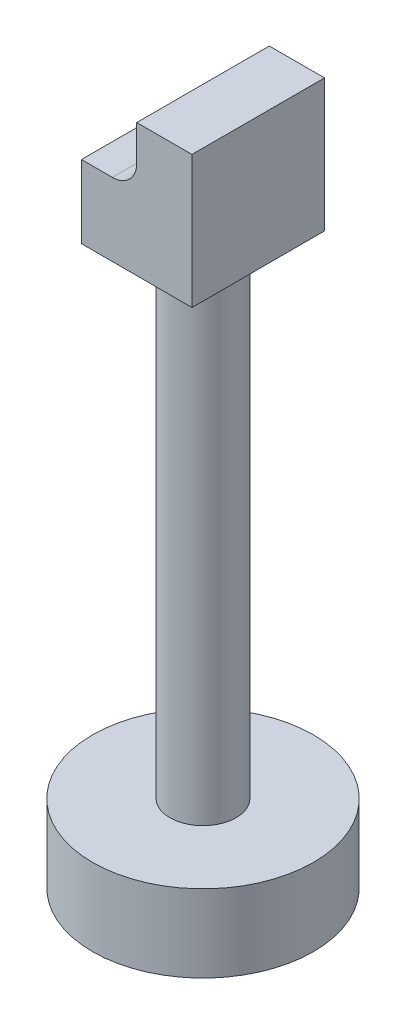
ISO-10303-21;
HEADER;
FILE_DESCRIPTION(('STEP AP214'),'2;1');
FILE_NAME('part.step','',(''),(''),'','','');
FILE_SCHEMA(('AUTOMOTIVE_DESIGN { 1 0 10303 214 1 1 1 1 }'));
ENDSEC;
DATA;
#1=APPLICATION_CONTEXT('core data for automotive mechanical design processes');
#2=APPLICATION_PROTOCOL_DEFINITION('international standard','automotive_design',2000,#1);
#3=PRODUCT_CONTEXT('',#1,'mechanical');
#4=PRODUCT('Part','Part','',(#3));
#5=PRODUCT_RELATED_PRODUCT_CATEGORY('part','',(#4));
#6=PRODUCT_DEFINITION_FORMATION('','',#4);
#7=PRODUCT_DEFINITION_CONTEXT('part definition',#1,'design');
#8=PRODUCT_DEFINITION('design','',#6,#7);
#9=PRODUCT_DEFINITION_SHAPE('','',#8);
#10=(LENGTH_UNIT() NAMED_UNIT(*) SI_UNIT(.MILLI.,.METRE.));
#11=(NAMED_UNIT(*) PLANE_ANGLE_UNIT() SI_UNIT($,.RADIAN.));
#12=(NAMED_UNIT(*) SI_UNIT($,.STERADIAN.) SOLID_ANGLE_UNIT());
#13=UNCERTAINTY_MEASURE_WITH_UNIT(LENGTH_MEASURE(1.E-05),#10,'distance_accuracy_value','');
#14=(GEOMETRIC_REPRESENTATION_CONTEXT(3) GLOBAL_UNCERTAINTY_ASSIGNED_CONTEXT((#13)) GLOBAL_UNIT_ASSIGNED_CONTEXT((#10,
#11,#12)) REPRESENTATION_CONTEXT('',''));
#15=CARTESIAN_POINT('',(0.,0.,0.));
#16=DIRECTION('',(0.,0.,1.));
#17=DIRECTION('',(1.,0.,0.));
#18=AXIS2_PLACEMENT_3D('',#15,#16,#17);
#19=CARTESIAN_POINT('',(0.,35.,0.));
#20=DIRECTION('',(0.,1.,0.));
#21=DIRECTION('',(0.,0.,1.));
#22=AXIS2_PLACEMENT_3D('',#19,#20,#21);
#23=PLANE('',#22);
#24=CARTESIAN_POINT('',(0.,35.,0.));
#25=DIRECTION('',(0.,1.,0.));
#26=DIRECTION('',(0.,0.,1.));
#27=AXIS2_PLACEMENT_3D('',#24,#25,#26);
#28=CIRCLE('',#27,50.);
#29=CARTESIAN_POINT('',(0.,35.,50.));
#30=VERTEX_POINT('',#29);
#31=EDGE_CURVE('E40',#30,#30,#28,.T.);
#32=ORIENTED_EDGE('',*,*,#31,.T.);
#33=EDGE_LOOP('',(#32));
#34=FACE_BOUND('',#33,.T.);
#35=CARTESIAN_POINT('',(0.,35.,0.));
#36=DIRECTION('',(0.,1.,0.));
#37=DIRECTION('',(0.,0.,1.));
#38=AXIS2_PLACEMENT_3D('',#35,#36,#37);
#39=CIRCLE('',#38,15.);
#40=CARTESIAN_POINT('',(0.,35.,15.));
#41=VERTEX_POINT('',#40);
#42=EDGE_CURVE('E114',#41,#41,#39,.T.);
#43=ORIENTED_EDGE('',*,*,#42,.F.);
#44=EDGE_LOOP('',(#43));
#45=FACE_BOUND('',#44,.T.);
#46=ADVANCED_FACE('F32',(#34,#45),#23,.T.);
#47=CARTESIAN_POINT('',(0.,35.,0.));
#48=DIRECTION('',(0.,-1.,0.));
#49=DIRECTION('',(0.,0.,-1.));
#50=AXIS2_PLACEMENT_3D('',#47,#48,#49);
#51=CYLINDRICAL_SURFACE('',#50,50.);
#52=ORIENTED_EDGE('',*,*,#31,.F.);
#53=EDGE_LOOP('',(#52));
#54=FACE_BOUND('',#53,.T.);
#55=CARTESIAN_POINT('',(0.,0.,0.));
#56=DIRECTION('',(0.,1.,0.));
#57=DIRECTION('',(0.,0.,1.));
#58=AXIS2_PLACEMENT_3D('',#55,#56,#57);
#59=CIRCLE('',#58,50.);
#60=CARTESIAN_POINT('',(0.,0.,50.));
#61=VERTEX_POINT('',#60);
#62=EDGE_CURVE('E118',#61,#61,#59,.T.);
#63=ORIENTED_EDGE('',*,*,#62,.T.);
#64=EDGE_LOOP('',(#63));
#65=FACE_BOUND('',#64,.T.);
#66=ADVANCED_FACE('F34',(#54,#65),#51,.T.);
#67=CARTESIAN_POINT('',(0.,0.,0.));
#68=DIRECTION('',(0.,1.,0.));
#69=DIRECTION('',(0.,0.,1.));
#70=AXIS2_PLACEMENT_3D('',#67,#68,#69);
#71=PLANE('',#70);
#72=ORIENTED_EDGE('',*,*,#62,.F.);
#73=EDGE_LOOP('',(#72));
#74=FACE_BOUND('',#73,.T.);
#75=ADVANCED_FACE('F126',(#74),#71,.F.);
#76=CARTESIAN_POINT('',(0.,255.,0.));
#77=DIRECTION('',(0.,-1.,0.));
#78=DIRECTION('',(0.,0.,-1.));
#79=AXIS2_PLACEMENT_3D('',#76,#77,#78);
#80=CYLINDRICAL_SURFACE('',#79,15.);
#81=CARTESIAN_POINT('',(0.,255.,0.));
#82=DIRECTION('',(0.,1.,0.));
#83=DIRECTION('',(0.,0.,1.));
#84=AXIS2_PLACEMENT_3D('',#81,#82,#83);
#85=CIRCLE('',#84,15.);
#86=CARTESIAN_POINT('',(0.,255.,15.));
#87=VERTEX_POINT('',#86);
#88=EDGE_CURVE('E115',#87,#87,#85,.T.);
#89=ORIENTED_EDGE('',*,*,#88,.F.);
#90=EDGE_LOOP('',(#89));
#91=FACE_BOUND('',#90,.T.);
#92=ORIENTED_EDGE('',*,*,#42,.T.);
#93=EDGE_LOOP('',(#92));
#94=FACE_BOUND('',#93,.T.);
#95=ADVANCED_FACE('F128',(#91,#94),#80,.T.);
#96=CARTESIAN_POINT('',(0.,255.,0.));
#97=DIRECTION('',(0.,-1.,0.));
#98=DIRECTION('',(0.,0.,-1.));
#99=AXIS2_PLACEMENT_3D('',#96,#97,#98);
#100=PLANE('',#99);
#101=DIRECTION('',(0.,0.,-1.));
#102=VECTOR('',#101,1.);
#103=CARTESIAN_POINT('',(25.,255.,30.));
#104=LINE('',#103,#102);
#105=CARTESIAN_POINT('',(25.,255.,30.));
#106=VERTEX_POINT('',#105);
#107=CARTESIAN_POINT('',(25.,255.,-30.));
#108=VERTEX_POINT('',#107);
#109=EDGE_CURVE('E92',#106,#108,#104,.T.);
#110=ORIENTED_EDGE('',*,*,#109,.F.);
#111=DIRECTION('',(1.,0.,0.));
#112=VECTOR('',#111,1.);
#113=CARTESIAN_POINT('',(-25.,255.,30.));
#114=LINE('',#113,#112);
#115=CARTESIAN_POINT('',(-25.,255.,30.));
#116=VERTEX_POINT('',#115);
#117=EDGE_CURVE('E73',#116,#106,#114,.T.);
#118=ORIENTED_EDGE('',*,*,#117,.F.);
#119=DIRECTION('',(0.,0.,1.));
#120=VECTOR('',#119,1.);
#121=CARTESIAN_POINT('',(-25.,255.,30.));
#122=LINE('',#121,#120);
#123=CARTESIAN_POINT('',(-25.,255.,-30.));
#124=VERTEX_POINT('',#123);
#125=EDGE_CURVE('E86',#124,#116,#122,.T.);
#126=ORIENTED_EDGE('',*,*,#125,.F.);
#127=DIRECTION('',(-1.,0.,0.));
#128=VECTOR('',#127,1.);
#129=CARTESIAN_POINT('',(-25.,255.,-30.));
#130=LINE('',#129,#128);
#131=EDGE_CURVE('E97',#108,#124,#130,.T.);
#132=ORIENTED_EDGE('',*,*,#131,.F.);
#133=EDGE_LOOP('',(#110,#118,#126,#132));
#134=FACE_BOUND('',#133,.T.);
#135=ORIENTED_EDGE('',*,*,#88,.T.);
#136=EDGE_LOOP('',(#135));
#137=FACE_BOUND('',#136,.T.);
#138=ADVANCED_FACE('F94',(#134,#137),#100,.T.);
#139=CARTESIAN_POINT('',(25.,315.,30.));
#140=DIRECTION('',(-1.,0.,0.));
#141=DIRECTION('',(0.,0.,1.));
#142=AXIS2_PLACEMENT_3D('',#139,#140,#141);
#143=PLANE('',#142);
#144=ORIENTED_EDGE('',*,*,#109,.T.);
#145=DIRECTION('',(0.,-1.,0.));
#146=VECTOR('',#145,1.);
#147=CARTESIAN_POINT('',(25.,315.,-30.));
#148=LINE('',#147,#146);
#149=CARTESIAN_POINT('',(25.,315.,-30.));
#150=VERTEX_POINT('',#149);
#151=EDGE_CURVE('E112',#150,#108,#148,.T.);
#152=ORIENTED_EDGE('',*,*,#151,.F.);
#153=DIRECTION('',(0.,0.,-1.));
#154=VECTOR('',#153,1.);
#155=CARTESIAN_POINT('',(25.,315.,30.));
#156=LINE('',#155,#154);
#157=CARTESIAN_POINT('',(25.,315.,30.));
#158=VERTEX_POINT('',#157);
#159=EDGE_CURVE('E85',#158,#150,#156,.T.);
#160=ORIENTED_EDGE('',*,*,#159,.F.);
#161=DIRECTION('',(0.,-1.,0.));
#162=VECTOR('',#161,1.);
#163=CARTESIAN_POINT('',(25.,315.,30.));
#164=LINE('',#163,#162);
#165=EDGE_CURVE('E76',#158,#106,#164,.T.);
#166=ORIENTED_EDGE('',*,*,#165,.T.);
#167=EDGE_LOOP('',(#144,#152,#160,#166));
#168=FACE_BOUND('',#167,.T.);
#169=ADVANCED_FACE('F90',(#168),#143,.F.);
#170=CARTESIAN_POINT('',(-25.,315.,-30.));
#171=DIRECTION('',(0.,0.,1.));
#172=DIRECTION('',(1.,0.,0.));
#173=AXIS2_PLACEMENT_3D('',#170,#171,#172);
#174=PLANE('',#173);
#175=CARTESIAN_POINT('',(-11.,299.,-30.));
#176=DIRECTION('',(0.,0.,1.));
#177=DIRECTION('',(1.,0.,0.));
#178=AXIS2_PLACEMENT_3D('',#175,#176,#177);
#179=CIRCLE('',#178,11.);
#180=CARTESIAN_POINT('',(-11.,288.,-30.));
#181=VERTEX_POINT('',#180);
#182=CARTESIAN_POINT('',(0.,299.,-30.));
#183=VERTEX_POINT('',#182);
#184=EDGE_CURVE('E99',#181,#183,#179,.T.);
#185=ORIENTED_EDGE('',*,*,#184,.T.);
#186=DIRECTION('',(0.,1.,0.));
#187=VECTOR('',#186,1.);
#188=CARTESIAN_POINT('',(0.,315.,-30.));
#189=LINE('',#188,#187);
#190=CARTESIAN_POINT('',(0.,315.,-30.));
#191=VERTEX_POINT('',#190);
#192=EDGE_CURVE('E179',#183,#191,#189,.T.);
#193=ORIENTED_EDGE('',*,*,#192,.T.);
#194=DIRECTION('',(-1.,0.,0.));
#195=VECTOR('',#194,1.);
#196=CARTESIAN_POINT('',(-25.,315.,-30.));
#197=LINE('',#196,#195);
#198=EDGE_CURVE('E203',#150,#191,#197,.T.);
#199=ORIENTED_EDGE('',*,*,#198,.F.);
#200=ORIENTED_EDGE('',*,*,#151,.T.);
#201=ORIENTED_EDGE('',*,*,#131,.T.);
#202=DIRECTION('',(0.,-1.,0.));
#203=VECTOR('',#202,1.);
#204=CARTESIAN_POINT('',(-25.,315.,-30.));
#205=LINE('',#204,#203);
#206=CARTESIAN_POINT('',(-25.,288.,-30.));
#207=VERTEX_POINT('',#206);
#208=EDGE_CURVE('E110',#207,#124,#205,.T.);
#209=ORIENTED_EDGE('',*,*,#208,.F.);
#210=DIRECTION('',(1.,0.,0.));
#211=VECTOR('',#210,1.);
#212=CARTESIAN_POINT('',(-25.,288.,-30.));
#213=LINE('',#212,#211);
#214=EDGE_CURVE('E103',#207,#181,#213,.T.);
#215=ORIENTED_EDGE('',*,*,#214,.T.);
#216=EDGE_LOOP('',(#185,#193,#199,#200,#201,#209,#215));
#217=FACE_BOUND('',#216,.T.);
#218=ADVANCED_FACE('F145',(#217),#174,.F.);
#219=CARTESIAN_POINT('',(-25.,315.,30.));
#220=DIRECTION('',(1.,0.,0.));
#221=DIRECTION('',(0.,0.,-1.));
#222=AXIS2_PLACEMENT_3D('',#219,#220,#221);
#223=PLANE('',#222);
#224=DIRECTION('',(0.,-1.,0.));
#225=VECTOR('',#224,1.);
#226=CARTESIAN_POINT('',(-25.,315.,30.));
#227=LINE('',#226,#225);
#228=CARTESIAN_POINT('',(-25.,288.,30.));
#229=VERTEX_POINT('',#228);
#230=EDGE_CURVE('E80',#229,#116,#227,.T.);
#231=ORIENTED_EDGE('',*,*,#230,.F.);
#232=DIRECTION('',(0.,0.,1.));
#233=VECTOR('',#232,1.);
#234=CARTESIAN_POINT('',(-25.,288.,-50.));
#235=LINE('',#234,#233);
#236=EDGE_CURVE('E193',#207,#229,#235,.T.);
#237=ORIENTED_EDGE('',*,*,#236,.F.);
#238=ORIENTED_EDGE('',*,*,#208,.T.);
#239=ORIENTED_EDGE('',*,*,#125,.T.);
#240=EDGE_LOOP('',(#231,#237,#238,#239));
#241=FACE_BOUND('',#240,.T.);
#242=ADVANCED_FACE('F148',(#241),#223,.F.);
#243=CARTESIAN_POINT('',(-25.,315.,30.));
#244=DIRECTION('',(0.,0.,-1.));
#245=DIRECTION('',(-1.,0.,0.));
#246=AXIS2_PLACEMENT_3D('',#243,#244,#245);
#247=PLANE('',#246);
#248=DIRECTION('',(1.,0.,0.));
#249=VECTOR('',#248,1.);
#250=CARTESIAN_POINT('',(-25.,315.,30.));
#251=LINE('',#250,#249);
#252=CARTESIAN_POINT('',(0.,315.,30.));
#253=VERTEX_POINT('',#252);
#254=EDGE_CURVE('E54',#253,#158,#251,.T.);
#255=ORIENTED_EDGE('',*,*,#254,.F.);
#256=DIRECTION('',(0.,1.,0.));
#257=VECTOR('',#256,1.);
#258=CARTESIAN_POINT('',(0.,315.,30.));
#259=LINE('',#258,#257);
#260=CARTESIAN_POINT('',(0.,299.,30.));
#261=VERTEX_POINT('',#260);
#262=EDGE_CURVE('E47',#261,#253,#259,.T.);
#263=ORIENTED_EDGE('',*,*,#262,.F.);
#264=CARTESIAN_POINT('',(-11.,299.,30.));
#265=DIRECTION('',(0.,0.,1.));
#266=DIRECTION('',(1.,0.,0.));
#267=AXIS2_PLACEMENT_3D('',#264,#265,#266);
#268=CIRCLE('',#267,11.);
#269=CARTESIAN_POINT('',(-11.,288.,30.));
#270=VERTEX_POINT('',#269);
#271=EDGE_CURVE('E188',#270,#261,#268,.T.);
#272=ORIENTED_EDGE('',*,*,#271,.F.);
#273=DIRECTION('',(1.,0.,0.));
#274=VECTOR('',#273,1.);
#275=CARTESIAN_POINT('',(-11.,288.,30.));
#276=LINE('',#275,#274);
#277=EDGE_CURVE('E191',#229,#270,#276,.T.);
#278=ORIENTED_EDGE('',*,*,#277,.F.);
#279=ORIENTED_EDGE('',*,*,#230,.T.);
#280=ORIENTED_EDGE('',*,*,#117,.T.);
#281=ORIENTED_EDGE('',*,*,#165,.F.);
#282=EDGE_LOOP('',(#255,#263,#272,#278,#279,#280,#281));
#283=FACE_BOUND('',#282,.T.);
#284=ADVANCED_FACE('F75',(#283),#247,.F.);
#285=CARTESIAN_POINT('',(0.,315.,0.));
#286=DIRECTION('',(0.,-1.,0.));
#287=DIRECTION('',(0.,0.,-1.));
#288=AXIS2_PLACEMENT_3D('',#285,#286,#287);
#289=PLANE('',#288);
#290=ORIENTED_EDGE('',*,*,#198,.T.);
#291=DIRECTION('',(0.,0.,1.));
#292=VECTOR('',#291,1.);
#293=CARTESIAN_POINT('',(0.,315.,0.));
#294=LINE('',#293,#292);
#295=EDGE_CURVE('E11',#191,#253,#294,.T.);
#296=ORIENTED_EDGE('',*,*,#295,.T.);
#297=ORIENTED_EDGE('',*,*,#254,.T.);
#298=ORIENTED_EDGE('',*,*,#159,.T.);
#299=EDGE_LOOP('',(#290,#296,#297,#298));
#300=FACE_BOUND('',#299,.T.);
#301=ADVANCED_FACE('F155',(#300),#289,.F.);
#302=CARTESIAN_POINT('',(-11.,299.,-50.));
#303=DIRECTION('',(0.,0.,1.));
#304=DIRECTION('',(1.,0.,0.));
#305=AXIS2_PLACEMENT_3D('',#302,#303,#304);
#306=CYLINDRICAL_SURFACE('',#305,11.);
#307=DIRECTION('',(0.,0.,1.));
#308=VECTOR('',#307,1.);
#309=CARTESIAN_POINT('',(-11.,288.,-50.));
#310=LINE('',#309,#308);
#311=EDGE_CURVE('E184',#181,#270,#310,.T.);
#312=ORIENTED_EDGE('',*,*,#311,.T.);
#313=ORIENTED_EDGE('',*,*,#271,.T.);
#314=DIRECTION('',(0.,0.,1.));
#315=VECTOR('',#314,1.);
#316=CARTESIAN_POINT('',(0.,299.,-50.));
#317=LINE('',#316,#315);
#318=EDGE_CURVE('E175',#183,#261,#317,.T.);
#319=ORIENTED_EDGE('',*,*,#318,.F.);
#320=ORIENTED_EDGE('',*,*,#184,.F.);
#321=EDGE_LOOP('',(#312,#313,#319,#320));
#322=FACE_BOUND('',#321,.T.);
#323=ADVANCED_FACE('F160',(#322),#306,.F.);
#324=CARTESIAN_POINT('',(-11.,288.,-50.));
#325=DIRECTION('',(0.,-1.,0.));
#326=DIRECTION('',(0.,0.,-1.));
#327=AXIS2_PLACEMENT_3D('',#324,#325,#326);
#328=PLANE('',#327);
#329=ORIENTED_EDGE('',*,*,#236,.T.);
#330=ORIENTED_EDGE('',*,*,#277,.T.);
#331=ORIENTED_EDGE('',*,*,#311,.F.);
#332=ORIENTED_EDGE('',*,*,#214,.F.);
#333=EDGE_LOOP('',(#329,#330,#331,#332));
#334=FACE_BOUND('',#333,.T.);
#335=ADVANCED_FACE('F161',(#334),#328,.F.);
#336=CARTESIAN_POINT('',(0.,315.,-50.));
#337=DIRECTION('',(1.,0.,0.));
#338=DIRECTION('',(0.,1.,0.));
#339=AXIS2_PLACEMENT_3D('',#336,#337,#338);
#340=PLANE('',#339);
#341=ORIENTED_EDGE('',*,*,#318,.T.);
#342=ORIENTED_EDGE('',*,*,#262,.T.);
#343=ORIENTED_EDGE('',*,*,#295,.F.);
#344=ORIENTED_EDGE('',*,*,#192,.F.);
#345=EDGE_LOOP('',(#341,#342,#343,#344));
#346=FACE_BOUND('',#345,.T.);
#347=ADVANCED_FACE('F164',(#346),#340,.F.);
#348=CLOSED_SHELL('',(#46,#66,#75,#95,#138,#169,#218,#242,#284,#301,#323,#335,#347));
#349=MANIFOLD_SOLID_BREP('B2',#348);
#350=ADVANCED_BREP_SHAPE_REPRESENTATION('',(#18,#349),#14);
#351=SHAPE_DEFINITION_REPRESENTATION(#9,#350);
ENDSEC;
END-ISO-10303-21;
